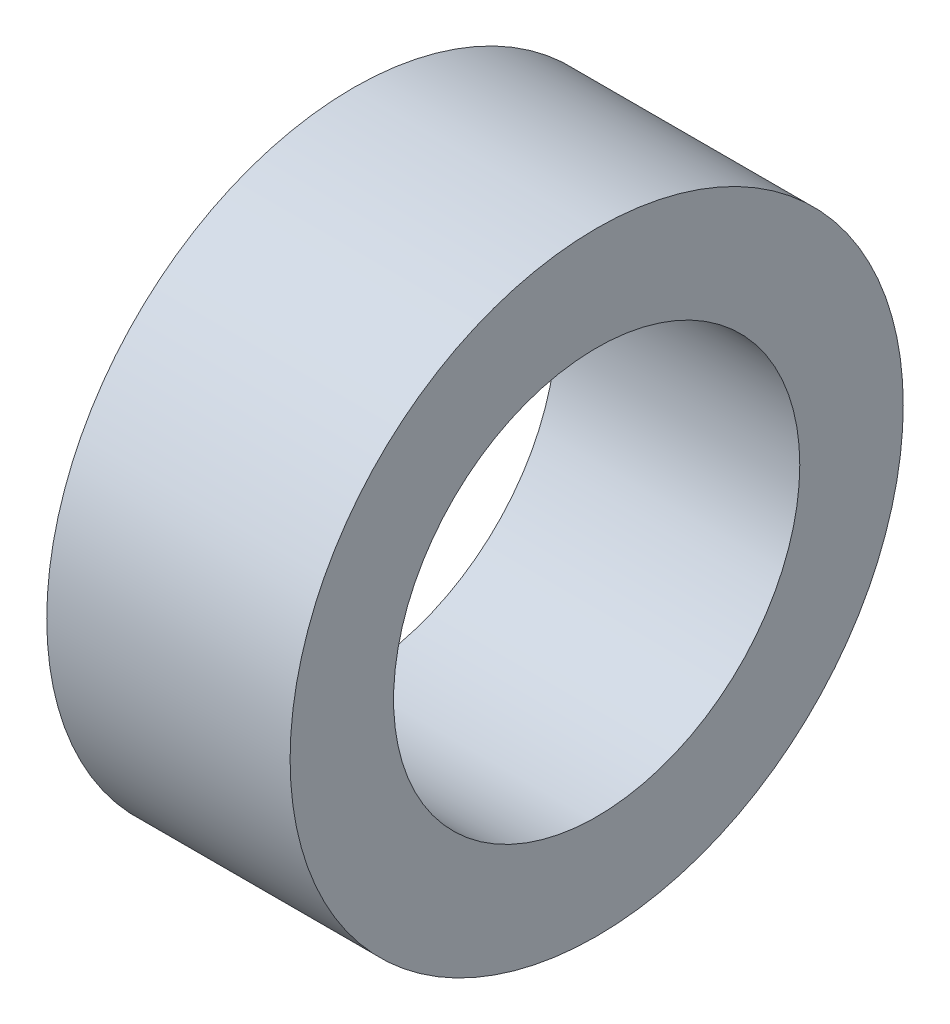
ISO-10303-21;
HEADER;
FILE_DESCRIPTION(('STEP AP214'),'2;1');
FILE_NAME('part.step','',(''),(''),'','','');
FILE_SCHEMA(('AUTOMOTIVE_DESIGN { 1 0 10303 214 1 1 1 1 }'));
ENDSEC;
DATA;
#1=APPLICATION_CONTEXT('core data for automotive mechanical design processes');
#2=APPLICATION_PROTOCOL_DEFINITION('international standard','automotive_design',2000,#1);
#3=PRODUCT_CONTEXT('',#1,'mechanical');
#4=PRODUCT('Part','Part','',(#3));
#5=PRODUCT_RELATED_PRODUCT_CATEGORY('part','',(#4));
#6=PRODUCT_DEFINITION_FORMATION('','',#4);
#7=PRODUCT_DEFINITION_CONTEXT('part definition',#1,'design');
#8=PRODUCT_DEFINITION('design','',#6,#7);
#9=PRODUCT_DEFINITION_SHAPE('','',#8);
#10=(LENGTH_UNIT() NAMED_UNIT(*) SI_UNIT(.MILLI.,.METRE.));
#11=(NAMED_UNIT(*) PLANE_ANGLE_UNIT() SI_UNIT($,.RADIAN.));
#12=(NAMED_UNIT(*) SI_UNIT($,.STERADIAN.) SOLID_ANGLE_UNIT());
#13=UNCERTAINTY_MEASURE_WITH_UNIT(LENGTH_MEASURE(1.E-05),#10,'distance_accuracy_value','');
#14=(GEOMETRIC_REPRESENTATION_CONTEXT(3) GLOBAL_UNCERTAINTY_ASSIGNED_CONTEXT((#13)) GLOBAL_UNIT_ASSIGNED_CONTEXT((#10,
#11,#12)) REPRESENTATION_CONTEXT('',''));
#15=CARTESIAN_POINT('',(0.,0.,0.));
#16=DIRECTION('',(0.,0.,1.));
#17=DIRECTION('',(1.,0.,0.));
#18=AXIS2_PLACEMENT_3D('',#15,#16,#17);
#19=CARTESIAN_POINT('',(3.175,0.,0.));
#20=DIRECTION('',(1.,0.,0.));
#21=DIRECTION('',(0.,0.,-1.));
#22=AXIS2_PLACEMENT_3D('',#19,#20,#21);
#23=PLANE('',#22);
#24=CARTESIAN_POINT('',(3.175,0.,0.));
#25=DIRECTION('',(1.,0.,0.));
#26=DIRECTION('',(0.,0.,-1.));
#27=AXIS2_PLACEMENT_3D('',#24,#25,#26);
#28=CIRCLE('',#27,4.);
#29=CARTESIAN_POINT('',(3.175,0.,-4.));
#30=VERTEX_POINT('',#29);
#31=EDGE_CURVE('E10',#30,#30,#28,.T.);
#32=ORIENTED_EDGE('',*,*,#31,.T.);
#33=EDGE_LOOP('',(#32));
#34=FACE_BOUND('',#33,.T.);
#35=CARTESIAN_POINT('',(3.175,0.,0.));
#36=DIRECTION('',(1.,0.,0.));
#37=DIRECTION('',(0.,0.,-1.));
#38=AXIS2_PLACEMENT_3D('',#35,#36,#37);
#39=CIRCLE('',#38,2.65);
#40=CARTESIAN_POINT('',(3.175,0.,-2.65));
#41=VERTEX_POINT('',#40);
#42=EDGE_CURVE('E42',#41,#41,#39,.T.);
#43=ORIENTED_EDGE('',*,*,#42,.F.);
#44=EDGE_LOOP('',(#43));
#45=FACE_BOUND('',#44,.T.);
#46=ADVANCED_FACE('F31',(#34,#45),#23,.T.);
#47=CARTESIAN_POINT('',(0.,0.,0.));
#48=DIRECTION('',(1.,0.,0.));
#49=DIRECTION('',(0.,0.,-1.));
#50=AXIS2_PLACEMENT_3D('',#47,#48,#49);
#51=PLANE('',#50);
#52=CARTESIAN_POINT('',(0.,0.,0.));
#53=DIRECTION('',(1.,0.,0.));
#54=DIRECTION('',(0.,0.,-1.));
#55=AXIS2_PLACEMENT_3D('',#52,#53,#54);
#56=CIRCLE('',#55,4.);
#57=CARTESIAN_POINT('',(0.,0.,-4.));
#58=VERTEX_POINT('',#57);
#59=EDGE_CURVE('E35',#58,#58,#56,.T.);
#60=ORIENTED_EDGE('',*,*,#59,.F.);
#61=EDGE_LOOP('',(#60));
#62=FACE_BOUND('',#61,.T.);
#63=CARTESIAN_POINT('',(0.,0.,0.));
#64=DIRECTION('',(1.,0.,0.));
#65=DIRECTION('',(0.,0.,-1.));
#66=AXIS2_PLACEMENT_3D('',#63,#64,#65);
#67=CIRCLE('',#66,2.65);
#68=CARTESIAN_POINT('',(0.,0.,-2.65));
#69=VERTEX_POINT('',#68);
#70=EDGE_CURVE('E44',#69,#69,#67,.T.);
#71=ORIENTED_EDGE('',*,*,#70,.T.);
#72=EDGE_LOOP('',(#71));
#73=FACE_BOUND('',#72,.T.);
#74=ADVANCED_FACE('F54',(#62,#73),#51,.F.);
#75=CARTESIAN_POINT('',(3.175,0.,0.));
#76=DIRECTION('',(-1.,0.,0.));
#77=DIRECTION('',(0.,0.,1.));
#78=AXIS2_PLACEMENT_3D('',#75,#76,#77);
#79=CYLINDRICAL_SURFACE('',#78,4.);
#80=ORIENTED_EDGE('',*,*,#31,.F.);
#81=EDGE_LOOP('',(#80));
#82=FACE_BOUND('',#81,.T.);
#83=ORIENTED_EDGE('',*,*,#59,.T.);
#84=EDGE_LOOP('',(#83));
#85=FACE_BOUND('',#84,.T.);
#86=ADVANCED_FACE('F33',(#82,#85),#79,.T.);
#87=CARTESIAN_POINT('',(3.175,0.,0.));
#88=DIRECTION('',(-1.,0.,0.));
#89=DIRECTION('',(0.,0.,1.));
#90=AXIS2_PLACEMENT_3D('',#87,#88,#89);
#91=CYLINDRICAL_SURFACE('',#90,2.65);
#92=ORIENTED_EDGE('',*,*,#42,.T.);
#93=EDGE_LOOP('',(#92));
#94=FACE_BOUND('',#93,.T.);
#95=ORIENTED_EDGE('',*,*,#70,.F.);
#96=EDGE_LOOP('',(#95));
#97=FACE_BOUND('',#96,.T.);
#98=ADVANCED_FACE('F50',(#94,#97),#91,.F.);
#99=CLOSED_SHELL('',(#46,#74,#86,#98));
#100=MANIFOLD_SOLID_BREP('B2',#99);
#101=ADVANCED_BREP_SHAPE_REPRESENTATION('',(#18,#100),#14);
#102=SHAPE_DEFINITION_REPRESENTATION(#9,#101);
ENDSEC;
END-ISO-10303-21;
